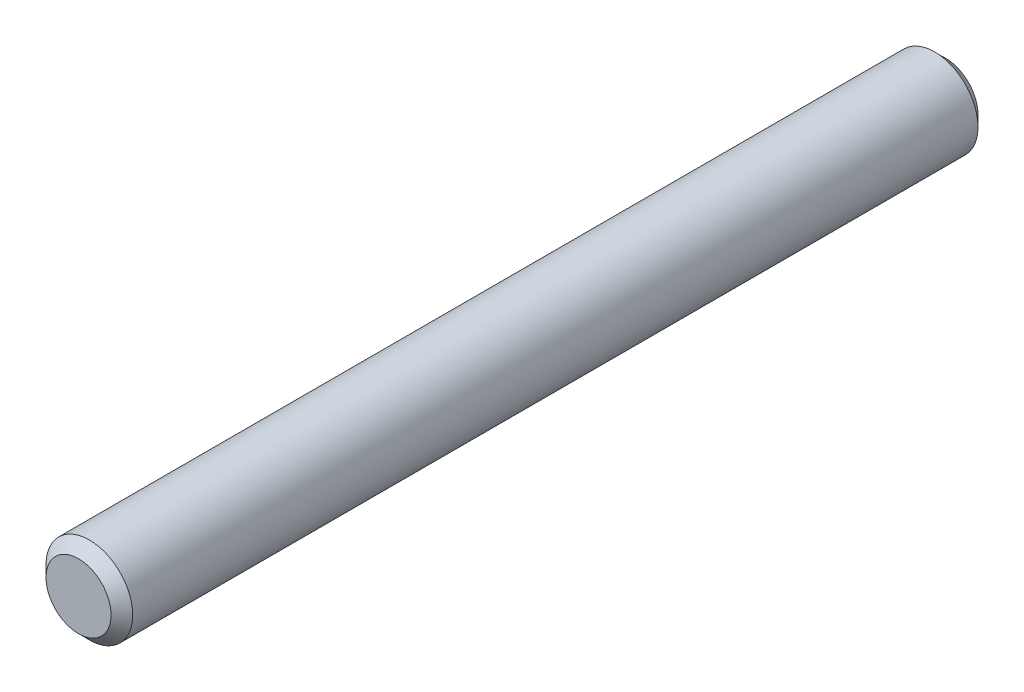
ISO-10303-21;
HEADER;
FILE_DESCRIPTION(('STEP AP214'),'2;1');
FILE_NAME('part.step','',(''),(''),'','','');
FILE_SCHEMA(('AUTOMOTIVE_DESIGN { 1 0 10303 214 1 1 1 1 }'));
ENDSEC;
DATA;
#1=APPLICATION_CONTEXT('core data for automotive mechanical design processes');
#2=APPLICATION_PROTOCOL_DEFINITION('international standard','automotive_design',2000,#1);
#3=PRODUCT_CONTEXT('',#1,'mechanical');
#4=PRODUCT('Part','Part','',(#3));
#5=PRODUCT_RELATED_PRODUCT_CATEGORY('part','',(#4));
#6=PRODUCT_DEFINITION_FORMATION('','',#4);
#7=PRODUCT_DEFINITION_CONTEXT('part definition',#1,'design');
#8=PRODUCT_DEFINITION('design','',#6,#7);
#9=PRODUCT_DEFINITION_SHAPE('','',#8);
#10=(LENGTH_UNIT() NAMED_UNIT(*) SI_UNIT(.MILLI.,.METRE.));
#11=(NAMED_UNIT(*) PLANE_ANGLE_UNIT() SI_UNIT($,.RADIAN.));
#12=(NAMED_UNIT(*) SI_UNIT($,.STERADIAN.) SOLID_ANGLE_UNIT());
#13=UNCERTAINTY_MEASURE_WITH_UNIT(LENGTH_MEASURE(1.E-05),#10,'distance_accuracy_value','');
#14=(GEOMETRIC_REPRESENTATION_CONTEXT(3) GLOBAL_UNCERTAINTY_ASSIGNED_CONTEXT((#13)) GLOBAL_UNIT_ASSIGNED_CONTEXT((#10,
#11,#12)) REPRESENTATION_CONTEXT('',''));
#15=CARTESIAN_POINT('',(0.,0.,0.));
#16=DIRECTION('',(0.,0.,1.));
#17=DIRECTION('',(1.,0.,0.));
#18=AXIS2_PLACEMENT_3D('',#15,#16,#17);
#19=CARTESIAN_POINT('',(0.,0.,40.));
#20=DIRECTION('',(0.,0.,-1.));
#21=DIRECTION('',(-1.,0.,0.));
#22=AXIS2_PLACEMENT_3D('',#19,#20,#21);
#23=CYLINDRICAL_SURFACE('',#22,4.);
#24=CARTESIAN_POINT('',(0.,0.,-39.));
#25=DIRECTION('',(0.,0.,1.));
#26=DIRECTION('',(1.,0.,0.));
#27=AXIS2_PLACEMENT_3D('',#24,#25,#26);
#28=CIRCLE('',#27,4.);
#29=CARTESIAN_POINT('',(4.,0.,-39.));
#30=VERTEX_POINT('',#29);
#31=EDGE_CURVE('E42',#30,#30,#28,.T.);
#32=ORIENTED_EDGE('',*,*,#31,.T.);
#33=EDGE_LOOP('',(#32));
#34=FACE_BOUND('',#33,.T.);
#35=CARTESIAN_POINT('',(0.,0.,39.));
#36=DIRECTION('',(0.,0.,1.));
#37=DIRECTION('',(1.,0.,0.));
#38=AXIS2_PLACEMENT_3D('',#35,#36,#37);
#39=CIRCLE('',#38,4.);
#40=CARTESIAN_POINT('',(4.,0.,39.));
#41=VERTEX_POINT('',#40);
#42=EDGE_CURVE('E46',#41,#41,#39,.F.);
#43=ORIENTED_EDGE('',*,*,#42,.T.);
#44=EDGE_LOOP('',(#43));
#45=FACE_BOUND('',#44,.T.);
#46=ADVANCED_FACE('F31',(#34,#45),#23,.T.);
#47=CARTESIAN_POINT('',(0.,0.,40.));
#48=DIRECTION('',(0.,0.,1.));
#49=DIRECTION('',(1.,0.,0.));
#50=AXIS2_PLACEMENT_3D('',#47,#48,#49);
#51=PLANE('',#50);
#52=CARTESIAN_POINT('',(0.,0.,40.));
#53=DIRECTION('',(0.,0.,1.));
#54=DIRECTION('',(1.,0.,0.));
#55=AXIS2_PLACEMENT_3D('',#52,#53,#54);
#56=CIRCLE('',#55,3.00000000000001);
#57=CARTESIAN_POINT('',(3.00000000000001,0.,40.));
#58=VERTEX_POINT('',#57);
#59=EDGE_CURVE('E10',#58,#58,#56,.T.);
#60=ORIENTED_EDGE('',*,*,#59,.T.);
#61=EDGE_LOOP('',(#60));
#62=FACE_BOUND('',#61,.T.);
#63=ADVANCED_FACE('F62',(#62),#51,.T.);
#64=CARTESIAN_POINT('',(0.,0.,-40.));
#65=DIRECTION('',(0.,0.,1.));
#66=DIRECTION('',(1.,0.,0.));
#67=AXIS2_PLACEMENT_3D('',#64,#65,#66);
#68=PLANE('',#67);
#69=CARTESIAN_POINT('',(0.,0.,-40.));
#70=DIRECTION('',(0.,0.,1.));
#71=DIRECTION('',(1.,0.,0.));
#72=AXIS2_PLACEMENT_3D('',#69,#70,#71);
#73=CIRCLE('',#72,2.99999999999997);
#74=CARTESIAN_POINT('',(2.99999999999997,0.,-40.));
#75=VERTEX_POINT('',#74);
#76=EDGE_CURVE('E38',#75,#75,#73,.F.);
#77=ORIENTED_EDGE('',*,*,#76,.T.);
#78=EDGE_LOOP('',(#77));
#79=FACE_BOUND('',#78,.T.);
#80=ADVANCED_FACE('F59',(#79),#68,.F.);
#81=CARTESIAN_POINT('',(0.,0.,-39.));
#82=DIRECTION('',(0.,0.,1.));
#83=DIRECTION('',(1.,0.,0.));
#84=AXIS2_PLACEMENT_3D('',#81,#82,#83);
#85=CONICAL_SURFACE('',#84,4.,0.78539816339745);
#86=ORIENTED_EDGE('',*,*,#76,.F.);
#87=EDGE_LOOP('',(#86));
#88=FACE_BOUND('',#87,.T.);
#89=ORIENTED_EDGE('',*,*,#31,.F.);
#90=EDGE_LOOP('',(#89));
#91=FACE_BOUND('',#90,.T.);
#92=ADVANCED_FACE('F55',(#88,#91),#85,.T.);
#93=CARTESIAN_POINT('',(0.,0.,40.));
#94=DIRECTION('',(0.,0.,-1.));
#95=DIRECTION('',(-1.,0.,0.));
#96=AXIS2_PLACEMENT_3D('',#93,#94,#95);
#97=CONICAL_SURFACE('',#96,3.00000000000001,0.785398163397447);
#98=ORIENTED_EDGE('',*,*,#42,.F.);
#99=EDGE_LOOP('',(#98));
#100=FACE_BOUND('',#99,.T.);
#101=ORIENTED_EDGE('',*,*,#59,.F.);
#102=EDGE_LOOP('',(#101));
#103=FACE_BOUND('',#102,.T.);
#104=ADVANCED_FACE('F33',(#100,#103),#97,.T.);
#105=CLOSED_SHELL('',(#46,#63,#80,#92,#104));
#106=MANIFOLD_SOLID_BREP('B2',#105);
#107=ADVANCED_BREP_SHAPE_REPRESENTATION('',(#18,#106),#14);
#108=SHAPE_DEFINITION_REPRESENTATION(#9,#107);
ENDSEC;
END-ISO-10303-21;
